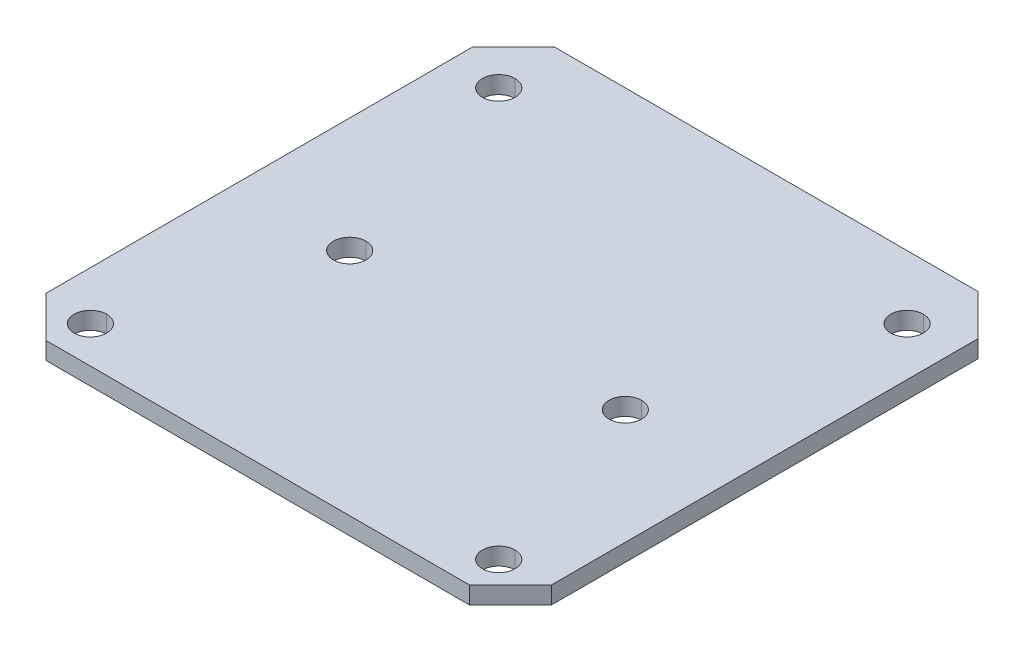
ISO-10303-21;
HEADER;
FILE_DESCRIPTION(('STEP AP214'),'2;1');
FILE_NAME('part.step','',(''),(''),'','','');
FILE_SCHEMA(('AUTOMOTIVE_DESIGN { 1 0 10303 214 1 1 1 1 }'));
ENDSEC;
DATA;
#1=APPLICATION_CONTEXT('core data for automotive mechanical design processes');
#2=APPLICATION_PROTOCOL_DEFINITION('international standard','automotive_design',2000,#1);
#3=PRODUCT_CONTEXT('',#1,'mechanical');
#4=PRODUCT('Part','Part','',(#3));
#5=PRODUCT_RELATED_PRODUCT_CATEGORY('part','',(#4));
#6=PRODUCT_DEFINITION_FORMATION('','',#4);
#7=PRODUCT_DEFINITION_CONTEXT('part definition',#1,'design');
#8=PRODUCT_DEFINITION('design','',#6,#7);
#9=PRODUCT_DEFINITION_SHAPE('','',#8);
#10=(LENGTH_UNIT() NAMED_UNIT(*) SI_UNIT(.MILLI.,.METRE.));
#11=(NAMED_UNIT(*) PLANE_ANGLE_UNIT() SI_UNIT($,.RADIAN.));
#12=(NAMED_UNIT(*) SI_UNIT($,.STERADIAN.) SOLID_ANGLE_UNIT());
#13=UNCERTAINTY_MEASURE_WITH_UNIT(LENGTH_MEASURE(1.E-05),#10,'distance_accuracy_value','');
#14=(GEOMETRIC_REPRESENTATION_CONTEXT(3) GLOBAL_UNCERTAINTY_ASSIGNED_CONTEXT((#13)) GLOBAL_UNIT_ASSIGNED_CONTEXT((#10,
#11,#12)) REPRESENTATION_CONTEXT('',''));
#15=CARTESIAN_POINT('',(0.,0.,0.));
#16=DIRECTION('',(0.,0.,1.));
#17=DIRECTION('',(1.,0.,0.));
#18=AXIS2_PLACEMENT_3D('',#15,#16,#17);
#19=CARTESIAN_POINT('',(-24.75,1.7,-20.9));
#20=DIRECTION('',(0.707106781186546,0.,0.707106781186549));
#21=DIRECTION('',(0.,-1.,0.));
#22=AXIS2_PLACEMENT_3D('',#19,#20,#21);
#23=PLANE('',#22);
#24=DIRECTION('',(-0.707106781186549,0.,0.707106781186546));
#25=VECTOR('',#24,1.);
#26=CARTESIAN_POINT('',(-22.825,1.7,-22.825));
#27=LINE('',#26,#25);
#28=CARTESIAN_POINT('',(-20.75,1.7,-24.9));
#29=VERTEX_POINT('',#28);
#30=CARTESIAN_POINT('',(-24.75,1.7,-20.9));
#31=VERTEX_POINT('',#30);
#32=EDGE_CURVE('E200',#29,#31,#27,.T.);
#33=ORIENTED_EDGE('',*,*,#32,.F.);
#34=DIRECTION('',(0.,1.,0.));
#35=VECTOR('',#34,1.);
#36=CARTESIAN_POINT('',(-20.75,1.7,-24.9));
#37=LINE('',#36,#35);
#38=CARTESIAN_POINT('',(-20.75,0.,-24.9));
#39=VERTEX_POINT('',#38);
#40=EDGE_CURVE('E202',#39,#29,#37,.T.);
#41=ORIENTED_EDGE('',*,*,#40,.F.);
#42=DIRECTION('',(0.707106781186549,0.,-0.707106781186546));
#43=VECTOR('',#42,1.);
#44=CARTESIAN_POINT('',(-24.75,0.,-20.9));
#45=LINE('',#44,#43);
#46=CARTESIAN_POINT('',(-24.75,0.,-20.9));
#47=VERTEX_POINT('',#46);
#48=EDGE_CURVE('E370',#47,#39,#45,.T.);
#49=ORIENTED_EDGE('',*,*,#48,.F.);
#50=DIRECTION('',(0.,-1.,0.));
#51=VECTOR('',#50,1.);
#52=CARTESIAN_POINT('',(-24.75,1.7,-20.9));
#53=LINE('',#52,#51);
#54=EDGE_CURVE('E205',#31,#47,#53,.T.);
#55=ORIENTED_EDGE('',*,*,#54,.F.);
#56=EDGE_LOOP('',(#33,#41,#49,#55));
#57=FACE_BOUND('',#56,.T.);
#58=ADVANCED_FACE('F19',(#57),#23,.F.);
#59=CARTESIAN_POINT('',(20.75,1.7,-24.9));
#60=DIRECTION('',(-0.707106781186549,0.,0.707106781186546));
#61=DIRECTION('',(0.,1.,0.));
#62=AXIS2_PLACEMENT_3D('',#59,#60,#61);
#63=PLANE('',#62);
#64=DIRECTION('',(-0.707106781186546,0.,-0.707106781186549));
#65=VECTOR('',#64,1.);
#66=CARTESIAN_POINT('',(22.825,1.7,-22.825));
#67=LINE('',#66,#65);
#68=CARTESIAN_POINT('',(24.75,1.7,-20.9));
#69=VERTEX_POINT('',#68);
#70=CARTESIAN_POINT('',(20.75,1.7,-24.9));
#71=VERTEX_POINT('',#70);
#72=EDGE_CURVE('E212',#69,#71,#67,.T.);
#73=ORIENTED_EDGE('',*,*,#72,.F.);
#74=DIRECTION('',(0.,1.,0.));
#75=VECTOR('',#74,1.);
#76=CARTESIAN_POINT('',(24.75,1.7,-20.9));
#77=LINE('',#76,#75);
#78=CARTESIAN_POINT('',(24.75,0.,-20.9));
#79=VERTEX_POINT('',#78);
#80=EDGE_CURVE('E229',#79,#69,#77,.T.);
#81=ORIENTED_EDGE('',*,*,#80,.F.);
#82=DIRECTION('',(0.707106781186546,0.,0.707106781186549));
#83=VECTOR('',#82,1.);
#84=CARTESIAN_POINT('',(20.75,0.,-24.9));
#85=LINE('',#84,#83);
#86=CARTESIAN_POINT('',(20.75,0.,-24.9));
#87=VERTEX_POINT('',#86);
#88=EDGE_CURVE('E359',#87,#79,#85,.T.);
#89=ORIENTED_EDGE('',*,*,#88,.F.);
#90=DIRECTION('',(0.,-1.,0.));
#91=VECTOR('',#90,1.);
#92=CARTESIAN_POINT('',(20.75,1.7,-24.9));
#93=LINE('',#92,#91);
#94=EDGE_CURVE('E228',#71,#87,#93,.T.);
#95=ORIENTED_EDGE('',*,*,#94,.F.);
#96=EDGE_LOOP('',(#73,#81,#89,#95));
#97=FACE_BOUND('',#96,.T.);
#98=ADVANCED_FACE('F449',(#97),#63,.F.);
#99=CARTESIAN_POINT('',(24.75,1.7,20.9));
#100=DIRECTION('',(-0.707106781186546,0.,-0.707106781186549));
#101=DIRECTION('',(-0.707106781186549,0.,0.707106781186546));
#102=AXIS2_PLACEMENT_3D('',#99,#100,#101);
#103=PLANE('',#102);
#104=DIRECTION('',(0.707106781186549,0.,-0.707106781186546));
#105=VECTOR('',#104,1.);
#106=CARTESIAN_POINT('',(22.825,1.7,22.825));
#107=LINE('',#106,#105);
#108=CARTESIAN_POINT('',(20.75,1.7,24.9));
#109=VERTEX_POINT('',#108);
#110=CARTESIAN_POINT('',(24.75,1.7,20.9));
#111=VERTEX_POINT('',#110);
#112=EDGE_CURVE('E322',#109,#111,#107,.T.);
#113=ORIENTED_EDGE('',*,*,#112,.F.);
#114=DIRECTION('',(0.,1.,0.));
#115=VECTOR('',#114,1.);
#116=CARTESIAN_POINT('',(20.75,1.7,24.9));
#117=LINE('',#116,#115);
#118=CARTESIAN_POINT('',(20.75,0.,24.9));
#119=VERTEX_POINT('',#118);
#120=EDGE_CURVE('E254',#119,#109,#117,.T.);
#121=ORIENTED_EDGE('',*,*,#120,.F.);
#122=DIRECTION('',(-0.707106781186549,0.,0.707106781186546));
#123=VECTOR('',#122,1.);
#124=CARTESIAN_POINT('',(24.75,0.,20.9));
#125=LINE('',#124,#123);
#126=CARTESIAN_POINT('',(24.75,0.,20.9));
#127=VERTEX_POINT('',#126);
#128=EDGE_CURVE('E44',#127,#119,#125,.T.);
#129=ORIENTED_EDGE('',*,*,#128,.F.);
#130=DIRECTION('',(0.,-1.,0.));
#131=VECTOR('',#130,1.);
#132=CARTESIAN_POINT('',(24.75,1.7,20.9));
#133=LINE('',#132,#131);
#134=EDGE_CURVE('E349',#111,#127,#133,.T.);
#135=ORIENTED_EDGE('',*,*,#134,.F.);
#136=EDGE_LOOP('',(#113,#121,#129,#135));
#137=FACE_BOUND('',#136,.T.);
#138=ADVANCED_FACE('F454',(#137),#103,.F.);
#139=CARTESIAN_POINT('',(-20.75,1.7,24.9));
#140=DIRECTION('',(0.707106781186549,0.,-0.707106781186546));
#141=DIRECTION('',(0.,-1.,0.));
#142=AXIS2_PLACEMENT_3D('',#139,#140,#141);
#143=PLANE('',#142);
#144=DIRECTION('',(0.707106781186546,0.,0.707106781186549));
#145=VECTOR('',#144,1.);
#146=CARTESIAN_POINT('',(-22.825,1.7,22.825));
#147=LINE('',#146,#145);
#148=CARTESIAN_POINT('',(-24.75,1.7,20.9));
#149=VERTEX_POINT('',#148);
#150=CARTESIAN_POINT('',(-20.75,1.7,24.9));
#151=VERTEX_POINT('',#150);
#152=EDGE_CURVE('E258',#149,#151,#147,.T.);
#153=ORIENTED_EDGE('',*,*,#152,.F.);
#154=DIRECTION('',(0.,1.,0.));
#155=VECTOR('',#154,1.);
#156=CARTESIAN_POINT('',(-24.75,1.7,20.9));
#157=LINE('',#156,#155);
#158=CARTESIAN_POINT('',(-24.75,0.,20.9));
#159=VERTEX_POINT('',#158);
#160=EDGE_CURVE('E247',#159,#149,#157,.T.);
#161=ORIENTED_EDGE('',*,*,#160,.F.);
#162=DIRECTION('',(-0.707106781186546,0.,-0.707106781186549));
#163=VECTOR('',#162,1.);
#164=CARTESIAN_POINT('',(-20.75,0.,24.9));
#165=LINE('',#164,#163);
#166=CARTESIAN_POINT('',(-20.75,0.,24.9));
#167=VERTEX_POINT('',#166);
#168=EDGE_CURVE('E367',#167,#159,#165,.T.);
#169=ORIENTED_EDGE('',*,*,#168,.F.);
#170=DIRECTION('',(0.,-1.,0.));
#171=VECTOR('',#170,1.);
#172=CARTESIAN_POINT('',(-20.75,1.7,24.9));
#173=LINE('',#172,#171);
#174=EDGE_CURVE('E303',#151,#167,#173,.T.);
#175=ORIENTED_EDGE('',*,*,#174,.F.);
#176=EDGE_LOOP('',(#153,#161,#169,#175));
#177=FACE_BOUND('',#176,.T.);
#178=ADVANCED_FACE('F462',(#177),#143,.F.);
#179=CARTESIAN_POINT('',(-13.5,1.7,2.4));
#180=DIRECTION('',(0.,1.,0.));
#181=DIRECTION('',(0.,0.,1.));
#182=AXIS2_PLACEMENT_3D('',#179,#180,#181);
#183=CYLINDRICAL_SURFACE('',#182,1.6);
#184=DIRECTION('',(0.,1.,0.));
#185=VECTOR('',#184,1.);
#186=CARTESIAN_POINT('',(-13.5,1.7,0.8));
#187=LINE('',#186,#185);
#188=CARTESIAN_POINT('',(-13.5,0.,0.8));
#189=VERTEX_POINT('',#188);
#190=CARTESIAN_POINT('',(-13.5,1.7,0.800000000000013));
#191=VERTEX_POINT('',#190);
#192=EDGE_CURVE('E299',#189,#191,#187,.T.);
#193=ORIENTED_EDGE('',*,*,#192,.F.);
#194=CARTESIAN_POINT('',(-13.5,0.,2.4));
#195=DIRECTION('',(0.,1.,0.));
#196=DIRECTION('',(0.,0.,1.));
#197=AXIS2_PLACEMENT_3D('',#194,#195,#196);
#198=CIRCLE('',#197,1.6);
#199=CARTESIAN_POINT('',(-13.5,0.,4.));
#200=VERTEX_POINT('',#199);
#201=EDGE_CURVE('E356',#200,#189,#198,.T.);
#202=ORIENTED_EDGE('',*,*,#201,.F.);
#203=DIRECTION('',(0.,1.,0.));
#204=VECTOR('',#203,1.);
#205=CARTESIAN_POINT('',(-13.5,1.7,4.));
#206=LINE('',#205,#204);
#207=CARTESIAN_POINT('',(-13.5,1.7,4.));
#208=VERTEX_POINT('',#207);
#209=EDGE_CURVE('E286',#200,#208,#206,.T.);
#210=ORIENTED_EDGE('',*,*,#209,.T.);
#211=CARTESIAN_POINT('',(-13.5,1.7,2.4));
#212=DIRECTION('',(0.,1.,0.));
#213=DIRECTION('',(0.,0.,1.));
#214=AXIS2_PLACEMENT_3D('',#211,#212,#213);
#215=CIRCLE('',#214,1.6);
#216=EDGE_CURVE('E211',#208,#191,#215,.T.);
#217=ORIENTED_EDGE('',*,*,#216,.T.);
#218=EDGE_LOOP('',(#193,#202,#210,#217));
#219=FACE_BOUND('',#218,.T.);
#220=ADVANCED_FACE('F425',(#219),#183,.F.);
#221=CARTESIAN_POINT('',(13.5,1.7,2.4));
#222=DIRECTION('',(0.,1.,0.));
#223=DIRECTION('',(0.,0.,1.));
#224=AXIS2_PLACEMENT_3D('',#221,#222,#223);
#225=CYLINDRICAL_SURFACE('',#224,1.6);
#226=DIRECTION('',(0.,1.,0.));
#227=VECTOR('',#226,1.);
#228=CARTESIAN_POINT('',(13.5,1.7,0.8));
#229=LINE('',#228,#227);
#230=CARTESIAN_POINT('',(13.5,0.,0.8));
#231=VERTEX_POINT('',#230);
#232=CARTESIAN_POINT('',(13.5,1.7,0.800000000000013));
#233=VERTEX_POINT('',#232);
#234=EDGE_CURVE('E270',#231,#233,#229,.T.);
#235=ORIENTED_EDGE('',*,*,#234,.F.);
#236=CARTESIAN_POINT('',(13.5,0.,2.4));
#237=DIRECTION('',(0.,1.,0.));
#238=DIRECTION('',(0.,0.,1.));
#239=AXIS2_PLACEMENT_3D('',#236,#237,#238);
#240=CIRCLE('',#239,1.6);
#241=CARTESIAN_POINT('',(13.5,0.,4.));
#242=VERTEX_POINT('',#241);
#243=EDGE_CURVE('E353',#242,#231,#240,.T.);
#244=ORIENTED_EDGE('',*,*,#243,.F.);
#245=DIRECTION('',(0.,1.,0.));
#246=VECTOR('',#245,1.);
#247=CARTESIAN_POINT('',(13.5,1.7,4.));
#248=LINE('',#247,#246);
#249=CARTESIAN_POINT('',(13.5,1.7,4.));
#250=VERTEX_POINT('',#249);
#251=EDGE_CURVE('E283',#242,#250,#248,.T.);
#252=ORIENTED_EDGE('',*,*,#251,.T.);
#253=CARTESIAN_POINT('',(13.5,1.7,2.4));
#254=DIRECTION('',(0.,1.,0.));
#255=DIRECTION('',(0.,0.,1.));
#256=AXIS2_PLACEMENT_3D('',#253,#254,#255);
#257=CIRCLE('',#256,1.6);
#258=EDGE_CURVE('E305',#250,#233,#257,.T.);
#259=ORIENTED_EDGE('',*,*,#258,.T.);
#260=EDGE_LOOP('',(#235,#244,#252,#259));
#261=FACE_BOUND('',#260,.T.);
#262=ADVANCED_FACE('F461',(#261),#225,.F.);
#263=CARTESIAN_POINT('',(-20.,1.7,21.3));
#264=DIRECTION('',(0.,1.,0.));
#265=DIRECTION('',(0.,0.,1.));
#266=AXIS2_PLACEMENT_3D('',#263,#264,#265);
#267=CYLINDRICAL_SURFACE('',#266,1.6);
#268=DIRECTION('',(0.,1.,0.));
#269=VECTOR('',#268,1.);
#270=CARTESIAN_POINT('',(-20.,1.7,19.7));
#271=LINE('',#270,#269);
#272=CARTESIAN_POINT('',(-20.,0.,19.7));
#273=VERTEX_POINT('',#272);
#274=CARTESIAN_POINT('',(-20.,1.7,19.7));
#275=VERTEX_POINT('',#274);
#276=EDGE_CURVE('E23',#273,#275,#271,.T.);
#277=ORIENTED_EDGE('',*,*,#276,.F.);
#278=CARTESIAN_POINT('',(-20.,0.,21.3));
#279=DIRECTION('',(0.,1.,0.));
#280=DIRECTION('',(0.,0.,1.));
#281=AXIS2_PLACEMENT_3D('',#278,#279,#280);
#282=CIRCLE('',#281,1.6);
#283=CARTESIAN_POINT('',(-20.,0.,22.9));
#284=VERTEX_POINT('',#283);
#285=EDGE_CURVE('E342',#284,#273,#282,.T.);
#286=ORIENTED_EDGE('',*,*,#285,.F.);
#287=DIRECTION('',(0.,1.,0.));
#288=VECTOR('',#287,1.);
#289=CARTESIAN_POINT('',(-20.,1.7,22.9));
#290=LINE('',#289,#288);
#291=CARTESIAN_POINT('',(-20.,1.7,22.9));
#292=VERTEX_POINT('',#291);
#293=EDGE_CURVE('E248',#284,#292,#290,.T.);
#294=ORIENTED_EDGE('',*,*,#293,.T.);
#295=CARTESIAN_POINT('',(-20.,1.7,21.3));
#296=DIRECTION('',(0.,1.,0.));
#297=DIRECTION('',(0.,0.,1.));
#298=AXIS2_PLACEMENT_3D('',#295,#296,#297);
#299=CIRCLE('',#298,1.6);
#300=EDGE_CURVE('E323',#292,#275,#299,.T.);
#301=ORIENTED_EDGE('',*,*,#300,.T.);
#302=EDGE_LOOP('',(#277,#286,#294,#301));
#303=FACE_BOUND('',#302,.T.);
#304=ADVANCED_FACE('F510',(#303),#267,.F.);
#305=CARTESIAN_POINT('',(20.,1.7,21.3));
#306=DIRECTION('',(0.,1.,0.));
#307=DIRECTION('',(0.,0.,1.));
#308=AXIS2_PLACEMENT_3D('',#305,#306,#307);
#309=CYLINDRICAL_SURFACE('',#308,1.6);
#310=DIRECTION('',(0.,1.,0.));
#311=VECTOR('',#310,1.);
#312=CARTESIAN_POINT('',(20.,1.7,19.7));
#313=LINE('',#312,#311);
#314=CARTESIAN_POINT('',(20.,0.,19.7));
#315=VERTEX_POINT('',#314);
#316=CARTESIAN_POINT('',(20.,1.7,19.7));
#317=VERTEX_POINT('',#316);
#318=EDGE_CURVE('E266',#315,#317,#313,.T.);
#319=ORIENTED_EDGE('',*,*,#318,.F.);
#320=CARTESIAN_POINT('',(20.,0.,21.3));
#321=DIRECTION('',(0.,1.,0.));
#322=DIRECTION('',(0.,0.,1.));
#323=AXIS2_PLACEMENT_3D('',#320,#321,#322);
#324=CIRCLE('',#323,1.6);
#325=CARTESIAN_POINT('',(20.,0.,22.9));
#326=VERTEX_POINT('',#325);
#327=EDGE_CURVE('E339',#326,#315,#324,.T.);
#328=ORIENTED_EDGE('',*,*,#327,.F.);
#329=DIRECTION('',(0.,1.,0.));
#330=VECTOR('',#329,1.);
#331=CARTESIAN_POINT('',(20.,1.7,22.9));
#332=LINE('',#331,#330);
#333=CARTESIAN_POINT('',(20.,1.7,22.9));
#334=VERTEX_POINT('',#333);
#335=EDGE_CURVE('E326',#326,#334,#332,.T.);
#336=ORIENTED_EDGE('',*,*,#335,.T.);
#337=CARTESIAN_POINT('',(20.,1.7,21.3));
#338=DIRECTION('',(0.,1.,0.));
#339=DIRECTION('',(0.,0.,1.));
#340=AXIS2_PLACEMENT_3D('',#337,#338,#339);
#341=CIRCLE('',#340,1.6);
#342=EDGE_CURVE('E265',#334,#317,#341,.T.);
#343=ORIENTED_EDGE('',*,*,#342,.T.);
#344=EDGE_LOOP('',(#319,#328,#336,#343));
#345=FACE_BOUND('',#344,.T.);
#346=ADVANCED_FACE('F537',(#345),#309,.F.);
#347=CARTESIAN_POINT('',(20.,1.7,-18.7));
#348=DIRECTION('',(0.,1.,0.));
#349=DIRECTION('',(0.,0.,1.));
#350=AXIS2_PLACEMENT_3D('',#347,#348,#349);
#351=CYLINDRICAL_SURFACE('',#350,1.6);
#352=DIRECTION('',(0.,1.,0.));
#353=VECTOR('',#352,1.);
#354=CARTESIAN_POINT('',(20.,1.7,-20.3));
#355=LINE('',#354,#353);
#356=CARTESIAN_POINT('',(20.,0.,-20.3));
#357=VERTEX_POINT('',#356);
#358=CARTESIAN_POINT('',(20.,1.7,-20.3));
#359=VERTEX_POINT('',#358);
#360=EDGE_CURVE('E243',#357,#359,#355,.T.);
#361=ORIENTED_EDGE('',*,*,#360,.F.);
#362=CARTESIAN_POINT('',(20.,0.,-18.7));
#363=DIRECTION('',(0.,1.,0.));
#364=DIRECTION('',(0.,0.,1.));
#365=AXIS2_PLACEMENT_3D('',#362,#363,#364);
#366=CIRCLE('',#365,1.6);
#367=CARTESIAN_POINT('',(20.,0.,-17.1));
#368=VERTEX_POINT('',#367);
#369=EDGE_CURVE('E30',#368,#357,#366,.T.);
#370=ORIENTED_EDGE('',*,*,#369,.F.);
#371=DIRECTION('',(0.,1.,0.));
#372=VECTOR('',#371,1.);
#373=CARTESIAN_POINT('',(20.,1.7,-17.1));
#374=LINE('',#373,#372);
#375=CARTESIAN_POINT('',(20.,1.7,-17.1));
#376=VERTEX_POINT('',#375);
#377=EDGE_CURVE('E319',#368,#376,#374,.T.);
#378=ORIENTED_EDGE('',*,*,#377,.T.);
#379=CARTESIAN_POINT('',(20.,1.7,-18.7));
#380=DIRECTION('',(0.,1.,0.));
#381=DIRECTION('',(0.,0.,1.));
#382=AXIS2_PLACEMENT_3D('',#379,#380,#381);
#383=CIRCLE('',#382,1.6);
#384=EDGE_CURVE('E260',#376,#359,#383,.T.);
#385=ORIENTED_EDGE('',*,*,#384,.T.);
#386=EDGE_LOOP('',(#361,#370,#378,#385));
#387=FACE_BOUND('',#386,.T.);
#388=ADVANCED_FACE('F535',(#387),#351,.F.);
#389=CARTESIAN_POINT('',(-20.,1.7,-18.7));
#390=DIRECTION('',(0.,1.,0.));
#391=DIRECTION('',(0.,0.,1.));
#392=AXIS2_PLACEMENT_3D('',#389,#390,#391);
#393=CYLINDRICAL_SURFACE('',#392,1.6);
#394=DIRECTION('',(0.,1.,0.));
#395=VECTOR('',#394,1.);
#396=CARTESIAN_POINT('',(-20.,1.7,-20.3));
#397=LINE('',#396,#395);
#398=CARTESIAN_POINT('',(-20.,0.,-20.3));
#399=VERTEX_POINT('',#398);
#400=CARTESIAN_POINT('',(-20.,1.7,-20.3));
#401=VERTEX_POINT('',#400);
#402=EDGE_CURVE('E312',#399,#401,#397,.T.);
#403=ORIENTED_EDGE('',*,*,#402,.F.);
#404=CARTESIAN_POINT('',(-20.,0.,-18.7));
#405=DIRECTION('',(0.,1.,0.));
#406=DIRECTION('',(0.,0.,1.));
#407=AXIS2_PLACEMENT_3D('',#404,#405,#406);
#408=CIRCLE('',#407,1.6);
#409=CARTESIAN_POINT('',(-20.,0.,-17.1));
#410=VERTEX_POINT('',#409);
#411=EDGE_CURVE('E11',#410,#399,#408,.T.);
#412=ORIENTED_EDGE('',*,*,#411,.F.);
#413=DIRECTION('',(0.,1.,0.));
#414=VECTOR('',#413,1.);
#415=CARTESIAN_POINT('',(-20.,1.7,-17.1));
#416=LINE('',#415,#414);
#417=CARTESIAN_POINT('',(-20.,1.7,-17.1));
#418=VERTEX_POINT('',#417);
#419=EDGE_CURVE('E311',#410,#418,#416,.T.);
#420=ORIENTED_EDGE('',*,*,#419,.T.);
#421=CARTESIAN_POINT('',(-20.,1.7,-18.7));
#422=DIRECTION('',(0.,1.,0.));
#423=DIRECTION('',(0.,0.,1.));
#424=AXIS2_PLACEMENT_3D('',#421,#422,#423);
#425=CIRCLE('',#424,1.6);
#426=EDGE_CURVE('E264',#418,#401,#425,.T.);
#427=ORIENTED_EDGE('',*,*,#426,.T.);
#428=EDGE_LOOP('',(#403,#412,#420,#427));
#429=FACE_BOUND('',#428,.T.);
#430=ADVANCED_FACE('F442',(#429),#393,.F.);
#431=CARTESIAN_POINT('',(0.,0.,0.));
#432=DIRECTION('',(0.,1.,0.));
#433=DIRECTION('',(1.,0.,0.));
#434=AXIS2_PLACEMENT_3D('',#431,#432,#433);
#435=PLANE('',#434);
#436=ORIENTED_EDGE('',*,*,#411,.T.);
#437=CARTESIAN_POINT('',(-20.,0.,-18.7));
#438=DIRECTION('',(0.,1.,0.));
#439=DIRECTION('',(0.,0.,1.));
#440=AXIS2_PLACEMENT_3D('',#437,#438,#439);
#441=CIRCLE('',#440,1.6);
#442=EDGE_CURVE('E338',#399,#410,#441,.T.);
#443=ORIENTED_EDGE('',*,*,#442,.T.);
#444=EDGE_LOOP('',(#436,#443));
#445=FACE_BOUND('',#444,.T.);
#446=ORIENTED_EDGE('',*,*,#369,.T.);
#447=CARTESIAN_POINT('',(20.,0.,-18.7));
#448=DIRECTION('',(0.,1.,0.));
#449=DIRECTION('',(0.,0.,1.));
#450=AXIS2_PLACEMENT_3D('',#447,#448,#449);
#451=CIRCLE('',#450,1.6);
#452=EDGE_CURVE('E330',#357,#368,#451,.T.);
#453=ORIENTED_EDGE('',*,*,#452,.T.);
#454=EDGE_LOOP('',(#446,#453));
#455=FACE_BOUND('',#454,.T.);
#456=ORIENTED_EDGE('',*,*,#327,.T.);
#457=CARTESIAN_POINT('',(20.,0.,21.3));
#458=DIRECTION('',(0.,1.,0.));
#459=DIRECTION('',(0.,0.,1.));
#460=AXIS2_PLACEMENT_3D('',#457,#458,#459);
#461=CIRCLE('',#460,1.6);
#462=EDGE_CURVE('E251',#315,#326,#461,.T.);
#463=ORIENTED_EDGE('',*,*,#462,.T.);
#464=EDGE_LOOP('',(#456,#463));
#465=FACE_BOUND('',#464,.T.);
#466=ORIENTED_EDGE('',*,*,#285,.T.);
#467=CARTESIAN_POINT('',(-20.,0.,21.3));
#468=DIRECTION('',(0.,1.,0.));
#469=DIRECTION('',(0.,0.,1.));
#470=AXIS2_PLACEMENT_3D('',#467,#468,#469);
#471=CIRCLE('',#470,1.6);
#472=EDGE_CURVE('E343',#273,#284,#471,.T.);
#473=ORIENTED_EDGE('',*,*,#472,.T.);
#474=EDGE_LOOP('',(#466,#473));
#475=FACE_BOUND('',#474,.T.);
#476=ORIENTED_EDGE('',*,*,#243,.T.);
#477=CARTESIAN_POINT('',(13.5,0.,2.4));
#478=DIRECTION('',(0.,1.,0.));
#479=DIRECTION('',(0.,0.,1.));
#480=AXIS2_PLACEMENT_3D('',#477,#478,#479);
#481=CIRCLE('',#480,1.6);
#482=EDGE_CURVE('E274',#231,#242,#481,.T.);
#483=ORIENTED_EDGE('',*,*,#482,.T.);
#484=EDGE_LOOP('',(#476,#483));
#485=FACE_BOUND('',#484,.T.);
#486=ORIENTED_EDGE('',*,*,#201,.T.);
#487=CARTESIAN_POINT('',(-13.5,0.,2.4));
#488=DIRECTION('',(0.,1.,0.));
#489=DIRECTION('',(0.,0.,1.));
#490=AXIS2_PLACEMENT_3D('',#487,#488,#489);
#491=CIRCLE('',#490,1.6);
#492=EDGE_CURVE('E390',#189,#200,#491,.T.);
#493=ORIENTED_EDGE('',*,*,#492,.T.);
#494=EDGE_LOOP('',(#486,#493));
#495=FACE_BOUND('',#494,.T.);
#496=DIRECTION('',(1.,0.,0.));
#497=VECTOR('',#496,1.);
#498=CARTESIAN_POINT('',(-24.75,0.,24.9));
#499=LINE('',#498,#497);
#500=EDGE_CURVE('E259',#167,#119,#499,.T.);
#501=ORIENTED_EDGE('',*,*,#500,.F.);
#502=ORIENTED_EDGE('',*,*,#168,.T.);
#503=DIRECTION('',(0.,0.,1.));
#504=VECTOR('',#503,1.);
#505=CARTESIAN_POINT('',(-24.75,0.,-24.9));
#506=LINE('',#505,#504);
#507=EDGE_CURVE('E222',#47,#159,#506,.T.);
#508=ORIENTED_EDGE('',*,*,#507,.F.);
#509=ORIENTED_EDGE('',*,*,#48,.T.);
#510=DIRECTION('',(-1.,0.,0.));
#511=VECTOR('',#510,1.);
#512=CARTESIAN_POINT('',(-24.75,0.,-24.9));
#513=LINE('',#512,#511);
#514=EDGE_CURVE('E220',#87,#39,#513,.T.);
#515=ORIENTED_EDGE('',*,*,#514,.F.);
#516=ORIENTED_EDGE('',*,*,#88,.T.);
#517=DIRECTION('',(0.,0.,-1.));
#518=VECTOR('',#517,1.);
#519=CARTESIAN_POINT('',(24.75,0.,-24.9));
#520=LINE('',#519,#518);
#521=EDGE_CURVE('E239',#127,#79,#520,.T.);
#522=ORIENTED_EDGE('',*,*,#521,.F.);
#523=ORIENTED_EDGE('',*,*,#128,.T.);
#524=EDGE_LOOP('',(#501,#502,#508,#509,#515,#516,#522,#523));
#525=FACE_BOUND('',#524,.T.);
#526=ADVANCED_FACE('F420',(#445,#455,#465,#475,#485,#495,#525),#435,.F.);
#527=CARTESIAN_POINT('',(0.,1.7,0.));
#528=DIRECTION('',(0.,1.,0.));
#529=DIRECTION('',(1.,0.,0.));
#530=AXIS2_PLACEMENT_3D('',#527,#528,#529);
#531=PLANE('',#530);
#532=ORIENTED_EDGE('',*,*,#426,.F.);
#533=CARTESIAN_POINT('',(-20.,1.7,-18.7));
#534=DIRECTION('',(0.,1.,0.));
#535=DIRECTION('',(0.,0.,1.));
#536=AXIS2_PLACEMENT_3D('',#533,#534,#535);
#537=CIRCLE('',#536,1.6);
#538=EDGE_CURVE('E307',#401,#418,#537,.T.);
#539=ORIENTED_EDGE('',*,*,#538,.F.);
#540=EDGE_LOOP('',(#532,#539));
#541=FACE_BOUND('',#540,.T.);
#542=ORIENTED_EDGE('',*,*,#384,.F.);
#543=CARTESIAN_POINT('',(20.,1.7,-18.7));
#544=DIRECTION('',(0.,1.,0.));
#545=DIRECTION('',(0.,0.,1.));
#546=AXIS2_PLACEMENT_3D('',#543,#544,#545);
#547=CIRCLE('',#546,1.6);
#548=EDGE_CURVE('E315',#359,#376,#547,.T.);
#549=ORIENTED_EDGE('',*,*,#548,.F.);
#550=EDGE_LOOP('',(#542,#549));
#551=FACE_BOUND('',#550,.T.);
#552=ORIENTED_EDGE('',*,*,#342,.F.);
#553=CARTESIAN_POINT('',(20.,1.7,21.3));
#554=DIRECTION('',(0.,1.,0.));
#555=DIRECTION('',(0.,0.,1.));
#556=AXIS2_PLACEMENT_3D('',#553,#554,#555);
#557=CIRCLE('',#556,1.6);
#558=EDGE_CURVE('E269',#317,#334,#557,.T.);
#559=ORIENTED_EDGE('',*,*,#558,.F.);
#560=EDGE_LOOP('',(#552,#559));
#561=FACE_BOUND('',#560,.T.);
#562=ORIENTED_EDGE('',*,*,#300,.F.);
#563=CARTESIAN_POINT('',(-20.,1.7,21.3));
#564=DIRECTION('',(0.,1.,0.));
#565=DIRECTION('',(0.,0.,1.));
#566=AXIS2_PLACEMENT_3D('',#563,#564,#565);
#567=CIRCLE('',#566,1.6);
#568=EDGE_CURVE('E252',#275,#292,#567,.T.);
#569=ORIENTED_EDGE('',*,*,#568,.F.);
#570=EDGE_LOOP('',(#562,#569));
#571=FACE_BOUND('',#570,.T.);
#572=ORIENTED_EDGE('',*,*,#258,.F.);
#573=CARTESIAN_POINT('',(13.5,1.7,2.4));
#574=DIRECTION('',(0.,1.,0.));
#575=DIRECTION('',(0.,0.,1.));
#576=AXIS2_PLACEMENT_3D('',#573,#574,#575);
#577=CIRCLE('',#576,1.6);
#578=EDGE_CURVE('E273',#233,#250,#577,.T.);
#579=ORIENTED_EDGE('',*,*,#578,.F.);
#580=EDGE_LOOP('',(#572,#579));
#581=FACE_BOUND('',#580,.T.);
#582=ORIENTED_EDGE('',*,*,#216,.F.);
#583=CARTESIAN_POINT('',(-13.5,1.7,2.4));
#584=DIRECTION('',(0.,1.,0.));
#585=DIRECTION('',(0.,0.,1.));
#586=AXIS2_PLACEMENT_3D('',#583,#584,#585);
#587=CIRCLE('',#586,1.6);
#588=EDGE_CURVE('E295',#191,#208,#587,.T.);
#589=ORIENTED_EDGE('',*,*,#588,.F.);
#590=EDGE_LOOP('',(#582,#589));
#591=FACE_BOUND('',#590,.T.);
#592=DIRECTION('',(0.,0.,1.));
#593=VECTOR('',#592,1.);
#594=CARTESIAN_POINT('',(-24.75,1.7,-24.9));
#595=LINE('',#594,#593);
#596=EDGE_CURVE('E401',#31,#149,#595,.T.);
#597=ORIENTED_EDGE('',*,*,#596,.T.);
#598=ORIENTED_EDGE('',*,*,#152,.T.);
#599=DIRECTION('',(1.,0.,0.));
#600=VECTOR('',#599,1.);
#601=CARTESIAN_POINT('',(-24.75,1.7,24.9));
#602=LINE('',#601,#600);
#603=EDGE_CURVE('E363',#151,#109,#602,.T.);
#604=ORIENTED_EDGE('',*,*,#603,.T.);
#605=ORIENTED_EDGE('',*,*,#112,.T.);
#606=DIRECTION('',(0.,0.,-1.));
#607=VECTOR('',#606,1.);
#608=CARTESIAN_POINT('',(24.75,1.7,-24.9));
#609=LINE('',#608,#607);
#610=EDGE_CURVE('E334',#111,#69,#609,.T.);
#611=ORIENTED_EDGE('',*,*,#610,.T.);
#612=ORIENTED_EDGE('',*,*,#72,.T.);
#613=DIRECTION('',(-1.,0.,0.));
#614=VECTOR('',#613,1.);
#615=CARTESIAN_POINT('',(-24.75,1.7,-24.9));
#616=LINE('',#615,#614);
#617=EDGE_CURVE('E218',#71,#29,#616,.T.);
#618=ORIENTED_EDGE('',*,*,#617,.T.);
#619=ORIENTED_EDGE('',*,*,#32,.T.);
#620=EDGE_LOOP('',(#597,#598,#604,#605,#611,#612,#618,#619));
#621=FACE_BOUND('',#620,.T.);
#622=ADVANCED_FACE('F224',(#541,#551,#561,#571,#581,#591,#621),#531,.T.);
#623=CARTESIAN_POINT('',(-24.75,1.7,24.9));
#624=DIRECTION('',(0.,0.,-1.));
#625=DIRECTION('',(0.,-1.,0.));
#626=AXIS2_PLACEMENT_3D('',#623,#624,#625);
#627=PLANE('',#626);
#628=ORIENTED_EDGE('',*,*,#603,.F.);
#629=ORIENTED_EDGE('',*,*,#174,.T.);
#630=ORIENTED_EDGE('',*,*,#500,.T.);
#631=ORIENTED_EDGE('',*,*,#120,.T.);
#632=EDGE_LOOP('',(#628,#629,#630,#631));
#633=FACE_BOUND('',#632,.T.);
#634=ADVANCED_FACE('F431',(#633),#627,.F.);
#635=CARTESIAN_POINT('',(-24.75,1.7,-24.9));
#636=DIRECTION('',(1.,0.,0.));
#637=DIRECTION('',(0.,0.,-1.));
#638=AXIS2_PLACEMENT_3D('',#635,#636,#637);
#639=PLANE('',#638);
#640=ORIENTED_EDGE('',*,*,#507,.T.);
#641=ORIENTED_EDGE('',*,*,#160,.T.);
#642=ORIENTED_EDGE('',*,*,#596,.F.);
#643=ORIENTED_EDGE('',*,*,#54,.T.);
#644=EDGE_LOOP('',(#640,#641,#642,#643));
#645=FACE_BOUND('',#644,.T.);
#646=ADVANCED_FACE('F439',(#645),#639,.F.);
#647=CARTESIAN_POINT('',(-24.75,1.7,-24.9));
#648=DIRECTION('',(0.,0.,1.));
#649=DIRECTION('',(1.,0.,0.));
#650=AXIS2_PLACEMENT_3D('',#647,#648,#649);
#651=PLANE('',#650);
#652=ORIENTED_EDGE('',*,*,#617,.F.);
#653=ORIENTED_EDGE('',*,*,#94,.T.);
#654=ORIENTED_EDGE('',*,*,#514,.T.);
#655=ORIENTED_EDGE('',*,*,#40,.T.);
#656=EDGE_LOOP('',(#652,#653,#654,#655));
#657=FACE_BOUND('',#656,.T.);
#658=ADVANCED_FACE('F216',(#657),#651,.F.);
#659=CARTESIAN_POINT('',(24.75,1.7,-24.9));
#660=DIRECTION('',(-1.,0.,0.));
#661=DIRECTION('',(0.,1.,0.));
#662=AXIS2_PLACEMENT_3D('',#659,#660,#661);
#663=PLANE('',#662);
#664=ORIENTED_EDGE('',*,*,#610,.F.);
#665=ORIENTED_EDGE('',*,*,#134,.T.);
#666=ORIENTED_EDGE('',*,*,#521,.T.);
#667=ORIENTED_EDGE('',*,*,#80,.T.);
#668=EDGE_LOOP('',(#664,#665,#666,#667));
#669=FACE_BOUND('',#668,.T.);
#670=ADVANCED_FACE('F21',(#669),#663,.F.);
#671=CARTESIAN_POINT('',(-20.,1.7,-18.7));
#672=DIRECTION('',(0.,1.,0.));
#673=DIRECTION('',(0.,0.,1.));
#674=AXIS2_PLACEMENT_3D('',#671,#672,#673);
#675=CYLINDRICAL_SURFACE('',#674,1.6);
#676=ORIENTED_EDGE('',*,*,#442,.F.);
#677=ORIENTED_EDGE('',*,*,#402,.T.);
#678=ORIENTED_EDGE('',*,*,#538,.T.);
#679=ORIENTED_EDGE('',*,*,#419,.F.);
#680=EDGE_LOOP('',(#676,#677,#678,#679));
#681=FACE_BOUND('',#680,.T.);
#682=ADVANCED_FACE('F520',(#681),#675,.F.);
#683=CARTESIAN_POINT('',(20.,1.7,-18.7));
#684=DIRECTION('',(0.,1.,0.));
#685=DIRECTION('',(0.,0.,1.));
#686=AXIS2_PLACEMENT_3D('',#683,#684,#685);
#687=CYLINDRICAL_SURFACE('',#686,1.6);
#688=ORIENTED_EDGE('',*,*,#452,.F.);
#689=ORIENTED_EDGE('',*,*,#360,.T.);
#690=ORIENTED_EDGE('',*,*,#548,.T.);
#691=ORIENTED_EDGE('',*,*,#377,.F.);
#692=EDGE_LOOP('',(#688,#689,#690,#691));
#693=FACE_BOUND('',#692,.T.);
#694=ADVANCED_FACE('F524',(#693),#687,.F.);
#695=CARTESIAN_POINT('',(20.,1.7,21.3));
#696=DIRECTION('',(0.,1.,0.));
#697=DIRECTION('',(0.,0.,1.));
#698=AXIS2_PLACEMENT_3D('',#695,#696,#697);
#699=CYLINDRICAL_SURFACE('',#698,1.6);
#700=ORIENTED_EDGE('',*,*,#462,.F.);
#701=ORIENTED_EDGE('',*,*,#318,.T.);
#702=ORIENTED_EDGE('',*,*,#558,.T.);
#703=ORIENTED_EDGE('',*,*,#335,.F.);
#704=EDGE_LOOP('',(#700,#701,#702,#703));
#705=FACE_BOUND('',#704,.T.);
#706=ADVANCED_FACE('F502',(#705),#699,.F.);
#707=CARTESIAN_POINT('',(-20.,1.7,21.3));
#708=DIRECTION('',(0.,1.,0.));
#709=DIRECTION('',(0.,0.,1.));
#710=AXIS2_PLACEMENT_3D('',#707,#708,#709);
#711=CYLINDRICAL_SURFACE('',#710,1.6);
#712=ORIENTED_EDGE('',*,*,#472,.F.);
#713=ORIENTED_EDGE('',*,*,#276,.T.);
#714=ORIENTED_EDGE('',*,*,#568,.T.);
#715=ORIENTED_EDGE('',*,*,#293,.F.);
#716=EDGE_LOOP('',(#712,#713,#714,#715));
#717=FACE_BOUND('',#716,.T.);
#718=ADVANCED_FACE('F497',(#717),#711,.F.);
#719=CARTESIAN_POINT('',(13.5,1.7,2.4));
#720=DIRECTION('',(0.,1.,0.));
#721=DIRECTION('',(0.,0.,1.));
#722=AXIS2_PLACEMENT_3D('',#719,#720,#721);
#723=CYLINDRICAL_SURFACE('',#722,1.6);
#724=ORIENTED_EDGE('',*,*,#482,.F.);
#725=ORIENTED_EDGE('',*,*,#234,.T.);
#726=ORIENTED_EDGE('',*,*,#578,.T.);
#727=ORIENTED_EDGE('',*,*,#251,.F.);
#728=EDGE_LOOP('',(#724,#725,#726,#727));
#729=FACE_BOUND('',#728,.T.);
#730=ADVANCED_FACE('F464',(#729),#723,.F.);
#731=CARTESIAN_POINT('',(-13.5,1.7,2.4));
#732=DIRECTION('',(0.,1.,0.));
#733=DIRECTION('',(0.,0.,1.));
#734=AXIS2_PLACEMENT_3D('',#731,#732,#733);
#735=CYLINDRICAL_SURFACE('',#734,1.6);
#736=ORIENTED_EDGE('',*,*,#492,.F.);
#737=ORIENTED_EDGE('',*,*,#192,.T.);
#738=ORIENTED_EDGE('',*,*,#588,.T.);
#739=ORIENTED_EDGE('',*,*,#209,.F.);
#740=EDGE_LOOP('',(#736,#737,#738,#739));
#741=FACE_BOUND('',#740,.T.);
#742=ADVANCED_FACE('F428',(#741),#735,.F.);
#743=CLOSED_SHELL('',(#58,#98,#138,#178,#220,#262,#304,#346,#388,#430,#526,#622,#634,#646,#658,
#670,#682,#694,#706,#718,#730,#742));
#744=MANIFOLD_SOLID_BREP('B1',#743);
#745=ADVANCED_BREP_SHAPE_REPRESENTATION('',(#18,#744),#14);
#746=SHAPE_DEFINITION_REPRESENTATION(#9,#745);
ENDSEC;
END-ISO-10303-21;
